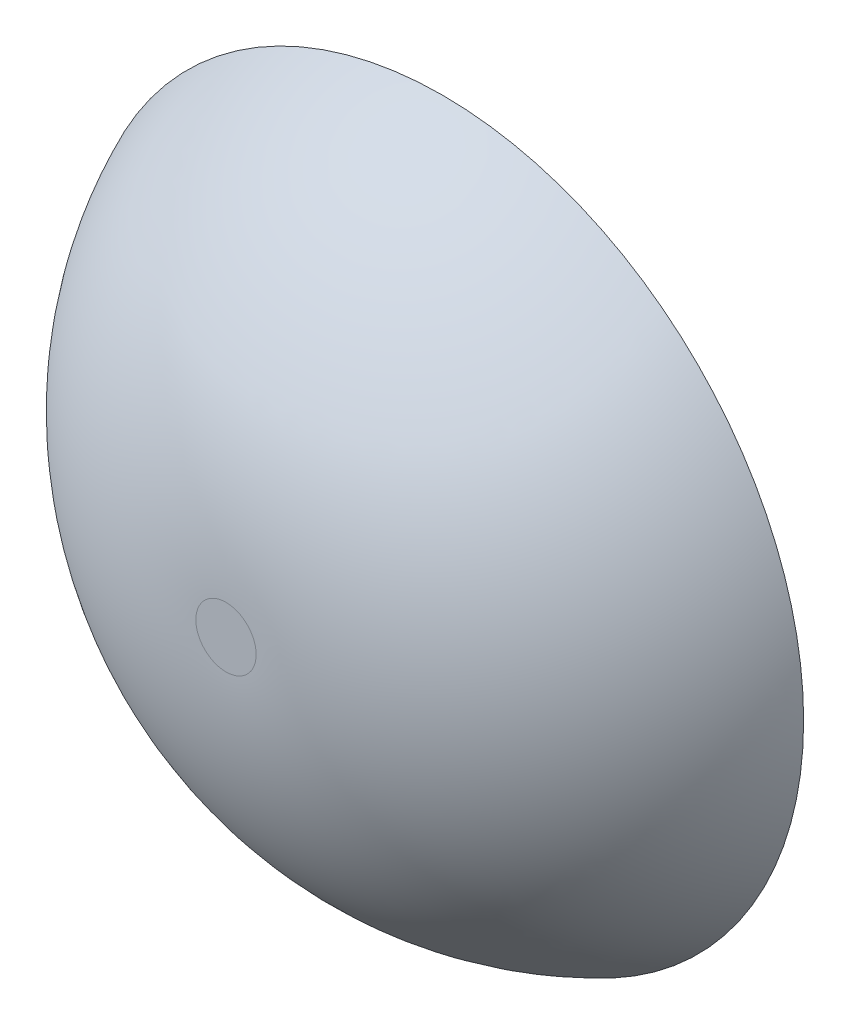
ISO-10303-21;
HEADER;
FILE_DESCRIPTION(('STEP AP214'),'2;1');
FILE_NAME('part.step','',(''),(''),'','','');
FILE_SCHEMA(('AUTOMOTIVE_DESIGN { 1 0 10303 214 1 1 1 1 }'));
ENDSEC;
DATA;
#1=APPLICATION_CONTEXT('core data for automotive mechanical design processes');
#2=APPLICATION_PROTOCOL_DEFINITION('international standard','automotive_design',2000,#1);
#3=PRODUCT_CONTEXT('',#1,'mechanical');
#4=PRODUCT('Part','Part','',(#3));
#5=PRODUCT_RELATED_PRODUCT_CATEGORY('part','',(#4));
#6=PRODUCT_DEFINITION_FORMATION('','',#4);
#7=PRODUCT_DEFINITION_CONTEXT('part definition',#1,'design');
#8=PRODUCT_DEFINITION('design','',#6,#7);
#9=PRODUCT_DEFINITION_SHAPE('','',#8);
#10=(LENGTH_UNIT() NAMED_UNIT(*) SI_UNIT(.MILLI.,.METRE.));
#11=(NAMED_UNIT(*) PLANE_ANGLE_UNIT() SI_UNIT($,.RADIAN.));
#12=(NAMED_UNIT(*) SI_UNIT($,.STERADIAN.) SOLID_ANGLE_UNIT());
#13=UNCERTAINTY_MEASURE_WITH_UNIT(LENGTH_MEASURE(1.E-05),#10,'distance_accuracy_value','');
#14=(GEOMETRIC_REPRESENTATION_CONTEXT(3) GLOBAL_UNCERTAINTY_ASSIGNED_CONTEXT((#13)) GLOBAL_UNIT_ASSIGNED_CONTEXT((#10,
#11,#12)) REPRESENTATION_CONTEXT('',''));
#15=CARTESIAN_POINT('',(0.,0.,0.));
#16=DIRECTION('',(0.,0.,1.));
#17=DIRECTION('',(1.,0.,0.));
#18=AXIS2_PLACEMENT_3D('',#15,#16,#17);
#19=CARTESIAN_POINT('',(0.,0.,3.75));
#20=DIRECTION('',(0.,0.,1.));
#21=DIRECTION('',(1.,0.,0.));
#22=AXIS2_PLACEMENT_3D('',#19,#20,#21);
#23=PLANE('',#22);
#24=CARTESIAN_POINT('',(2.,2.,3.75));
#25=DIRECTION('',(0.,0.,-1.));
#26=DIRECTION('',(0.,-1.,0.));
#27=AXIS2_PLACEMENT_3D('',#24,#25,#26);
#28=CIRCLE('',#27,0.0417424305044199);
#29=CARTESIAN_POINT('',(2.,1.95825756949558,3.75));
#30=VERTEX_POINT('',#29);
#31=CARTESIAN_POINT('',(2.,2.04174243050442,3.75));
#32=VERTEX_POINT('',#31);
#33=EDGE_CURVE('E36',#30,#32,#28,.T.);
#34=ORIENTED_EDGE('',*,*,#33,.F.);
#35=CARTESIAN_POINT('',(2.,2.,3.75));
#36=DIRECTION('',(0.,0.,-1.));
#37=DIRECTION('',(0.,1.,0.));
#38=AXIS2_PLACEMENT_3D('',#35,#36,#37);
#39=CIRCLE('',#38,0.0417424305044199);
#40=EDGE_CURVE('E27',#32,#30,#39,.T.);
#41=ORIENTED_EDGE('',*,*,#40,.F.);
#42=EDGE_LOOP('',(#34,#41));
#43=FACE_BOUND('',#42,.T.);
#44=ADVANCED_FACE('F17',(#43),#23,.T.);
#45=CARTESIAN_POINT('',(2.,2.04174243050442,3.25));
#46=DIRECTION('',(-1.,0.,0.));
#47=DIRECTION('',(0.,1.,0.));
#48=AXIS2_PLACEMENT_3D('',#45,#46,#47);
#49=CIRCLE('',#48,0.5);
#50=TRIMMED_CURVE('',#49,(PARAMETER_VALUE(-1.65437847094237)),
(PARAMETER_VALUE(1.65437847094237)),.T.,.PARAMETER.);
#51=CARTESIAN_POINT('',(2.,2.,3.25));
#52=DIRECTION('',(0.,0.,1.));
#53=AXIS1_PLACEMENT('',#51,#52);
#54=SURFACE_OF_REVOLUTION('',#50,#53);
#55=ORIENTED_EDGE('',*,*,#33,.T.);
#56=ORIENTED_EDGE('',*,*,#40,.T.);
#57=EDGE_LOOP('',(#55,#56));
#58=FACE_BOUND('',#57,.T.);
#59=CARTESIAN_POINT('',(2.,2.,3.45));
#60=DIRECTION('',(0.,0.,1.));
#61=DIRECTION('',(1.,0.,0.));
#62=AXIS2_PLACEMENT_3D('',#59,#60,#61);
#63=CIRCLE('',#62,0.5);
#64=CARTESIAN_POINT('',(2.5,2.,3.45));
#65=VERTEX_POINT('',#64);
#66=EDGE_CURVE('E11',#65,#65,#63,.T.);
#67=ORIENTED_EDGE('',*,*,#66,.T.);
#68=EDGE_LOOP('',(#67));
#69=FACE_BOUND('',#68,.T.);
#70=ADVANCED_FACE('F37',(#58,#69),#54,.F.);
#71=CARTESIAN_POINT('',(0.,0.,3.45));
#72=DIRECTION('',(0.,0.,1.));
#73=DIRECTION('',(1.,0.,0.));
#74=AXIS2_PLACEMENT_3D('',#71,#72,#73);
#75=PLANE('',#74);
#76=ORIENTED_EDGE('',*,*,#66,.F.);
#77=EDGE_LOOP('',(#76));
#78=FACE_BOUND('',#77,.T.);
#79=ADVANCED_FACE('F65',(#78),#75,.F.);
#80=CLOSED_SHELL('',(#44,#70,#79));
#81=MANIFOLD_SOLID_BREP('B1',#80);
#82=ADVANCED_BREP_SHAPE_REPRESENTATION('',(#18,#81),#14);
#83=SHAPE_DEFINITION_REPRESENTATION(#9,#82);
ENDSEC;
END-ISO-10303-21;
